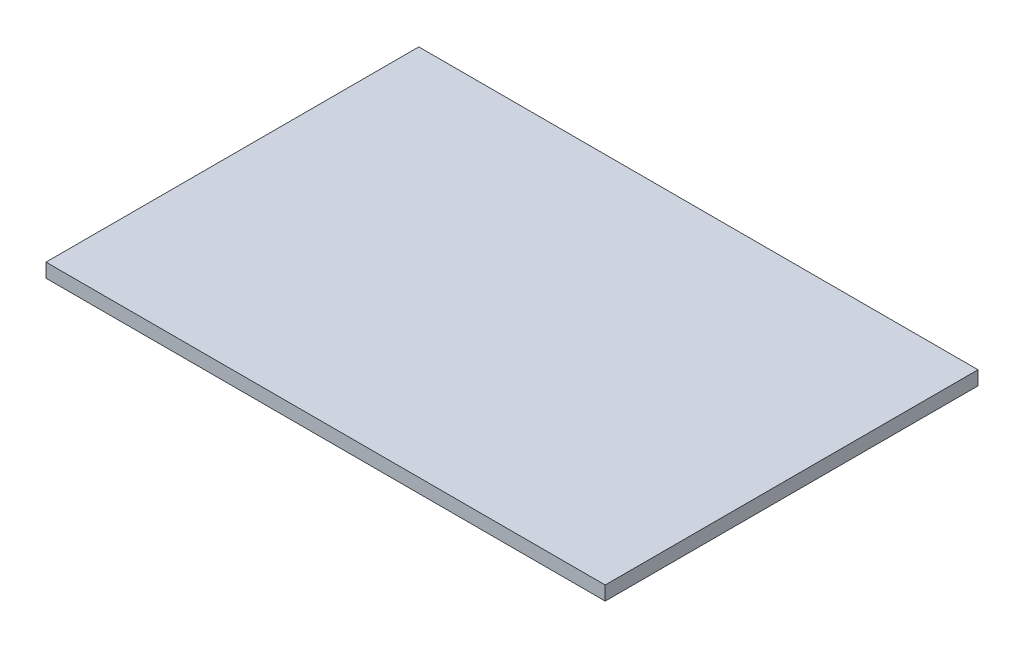
ISO-10303-21;
HEADER;
FILE_DESCRIPTION(('STEP AP214'),'2;1');
FILE_NAME('part.step','',(''),(''),'','','');
FILE_SCHEMA(('AUTOMOTIVE_DESIGN { 1 0 10303 214 1 1 1 1 }'));
ENDSEC;
DATA;
#1=APPLICATION_CONTEXT('core data for automotive mechanical design processes');
#2=APPLICATION_PROTOCOL_DEFINITION('international standard','automotive_design',2000,#1);
#3=PRODUCT_CONTEXT('',#1,'mechanical');
#4=PRODUCT('Part','Part','',(#3));
#5=PRODUCT_RELATED_PRODUCT_CATEGORY('part','',(#4));
#6=PRODUCT_DEFINITION_FORMATION('','',#4);
#7=PRODUCT_DEFINITION_CONTEXT('part definition',#1,'design');
#8=PRODUCT_DEFINITION('design','',#6,#7);
#9=PRODUCT_DEFINITION_SHAPE('','',#8);
#10=(LENGTH_UNIT() NAMED_UNIT(*) SI_UNIT(.MILLI.,.METRE.));
#11=(NAMED_UNIT(*) PLANE_ANGLE_UNIT() SI_UNIT($,.RADIAN.));
#12=(NAMED_UNIT(*) SI_UNIT($,.STERADIAN.) SOLID_ANGLE_UNIT());
#13=UNCERTAINTY_MEASURE_WITH_UNIT(LENGTH_MEASURE(1.E-05),#10,'distance_accuracy_value','');
#14=(GEOMETRIC_REPRESENTATION_CONTEXT(3) GLOBAL_UNCERTAINTY_ASSIGNED_CONTEXT((#13)) GLOBAL_UNIT_ASSIGNED_CONTEXT((#10,
#11,#12)) REPRESENTATION_CONTEXT('',''));
#15=CARTESIAN_POINT('',(0.,0.,0.));
#16=DIRECTION('',(0.,0.,1.));
#17=DIRECTION('',(1.,0.,0.));
#18=AXIS2_PLACEMENT_3D('',#15,#16,#17);
#19=CARTESIAN_POINT('',(6.,0.299999999999932,-4.));
#20=DIRECTION('',(-1.,0.,0.));
#21=DIRECTION('',(0.,0.,1.));
#22=AXIS2_PLACEMENT_3D('',#19,#20,#21);
#23=PLANE('',#22);
#24=DIRECTION('',(0.,0.,-1.));
#25=VECTOR('',#24,1.);
#26=CARTESIAN_POINT('',(6.,0.,-4.));
#27=LINE('',#26,#25);
#28=CARTESIAN_POINT('',(6.,0.,4.));
#29=VERTEX_POINT('',#28);
#30=CARTESIAN_POINT('',(6.,0.,-4.));
#31=VERTEX_POINT('',#30);
#32=EDGE_CURVE('E107',#29,#31,#27,.T.);
#33=ORIENTED_EDGE('',*,*,#32,.T.);
#34=DIRECTION('',(0.,-1.,0.));
#35=VECTOR('',#34,1.);
#36=CARTESIAN_POINT('',(6.,0.299999999999932,-4.));
#37=LINE('',#36,#35);
#38=CARTESIAN_POINT('',(6.,0.299999999999932,-4.));
#39=VERTEX_POINT('',#38);
#40=EDGE_CURVE('E11',#39,#31,#37,.T.);
#41=ORIENTED_EDGE('',*,*,#40,.F.);
#42=DIRECTION('',(0.,0.,-1.));
#43=VECTOR('',#42,1.);
#44=CARTESIAN_POINT('',(6.,0.299999999999932,-4.));
#45=LINE('',#44,#43);
#46=CARTESIAN_POINT('',(6.,0.299999999999932,4.));
#47=VERTEX_POINT('',#46);
#48=EDGE_CURVE('E91',#47,#39,#45,.T.);
#49=ORIENTED_EDGE('',*,*,#48,.F.);
#50=DIRECTION('',(0.,-1.,0.));
#51=VECTOR('',#50,1.);
#52=CARTESIAN_POINT('',(6.,0.299999999999932,4.));
#53=LINE('',#52,#51);
#54=EDGE_CURVE('E103',#47,#29,#53,.T.);
#55=ORIENTED_EDGE('',*,*,#54,.T.);
#56=EDGE_LOOP('',(#33,#41,#49,#55));
#57=FACE_BOUND('',#56,.T.);
#58=ADVANCED_FACE('F39',(#57),#23,.F.);
#59=CARTESIAN_POINT('',(-6.,0.299999999999932,-4.));
#60=DIRECTION('',(0.,0.,1.));
#61=DIRECTION('',(1.,0.,0.));
#62=AXIS2_PLACEMENT_3D('',#59,#60,#61);
#63=PLANE('',#62);
#64=DIRECTION('',(-1.,0.,0.));
#65=VECTOR('',#64,1.);
#66=CARTESIAN_POINT('',(-6.,0.,-4.));
#67=LINE('',#66,#65);
#68=CARTESIAN_POINT('',(-6.,0.,-4.));
#69=VERTEX_POINT('',#68);
#70=EDGE_CURVE('E96',#31,#69,#67,.T.);
#71=ORIENTED_EDGE('',*,*,#70,.T.);
#72=DIRECTION('',(0.,-1.,0.));
#73=VECTOR('',#72,1.);
#74=CARTESIAN_POINT('',(-6.,0.299999999999932,-4.));
#75=LINE('',#74,#73);
#76=CARTESIAN_POINT('',(-6.,0.299999999999932,-4.));
#77=VERTEX_POINT('',#76);
#78=EDGE_CURVE('E48',#77,#69,#75,.T.);
#79=ORIENTED_EDGE('',*,*,#78,.F.);
#80=DIRECTION('',(-1.,0.,0.));
#81=VECTOR('',#80,1.);
#82=CARTESIAN_POINT('',(-6.,0.299999999999932,-4.));
#83=LINE('',#82,#81);
#84=EDGE_CURVE('E86',#39,#77,#83,.T.);
#85=ORIENTED_EDGE('',*,*,#84,.F.);
#86=ORIENTED_EDGE('',*,*,#40,.T.);
#87=EDGE_LOOP('',(#71,#79,#85,#86));
#88=FACE_BOUND('',#87,.T.);
#89=ADVANCED_FACE('F95',(#88),#63,.F.);
#90=CARTESIAN_POINT('',(-6.,0.299999999999932,-4.));
#91=DIRECTION('',(1.,0.,0.));
#92=DIRECTION('',(0.,0.,-1.));
#93=AXIS2_PLACEMENT_3D('',#90,#91,#92);
#94=PLANE('',#93);
#95=DIRECTION('',(0.,0.,1.));
#96=VECTOR('',#95,1.);
#97=CARTESIAN_POINT('',(-6.,0.,-4.));
#98=LINE('',#97,#96);
#99=CARTESIAN_POINT('',(-6.,0.,4.));
#100=VERTEX_POINT('',#99);
#101=EDGE_CURVE('E73',#69,#100,#98,.T.);
#102=ORIENTED_EDGE('',*,*,#101,.T.);
#103=DIRECTION('',(0.,-1.,0.));
#104=VECTOR('',#103,1.);
#105=CARTESIAN_POINT('',(-6.,0.299999999999932,4.));
#106=LINE('',#105,#104);
#107=CARTESIAN_POINT('',(-6.,0.299999999999932,4.));
#108=VERTEX_POINT('',#107);
#109=EDGE_CURVE('E98',#108,#100,#106,.T.);
#110=ORIENTED_EDGE('',*,*,#109,.F.);
#111=DIRECTION('',(0.,0.,1.));
#112=VECTOR('',#111,1.);
#113=CARTESIAN_POINT('',(-6.,0.299999999999932,-4.));
#114=LINE('',#113,#112);
#115=EDGE_CURVE('E89',#77,#108,#114,.T.);
#116=ORIENTED_EDGE('',*,*,#115,.F.);
#117=ORIENTED_EDGE('',*,*,#78,.T.);
#118=EDGE_LOOP('',(#102,#110,#116,#117));
#119=FACE_BOUND('',#118,.T.);
#120=ADVANCED_FACE('F99',(#119),#94,.F.);
#121=CARTESIAN_POINT('',(-6.,0.299999999999932,4.));
#122=DIRECTION('',(0.,0.,-1.));
#123=DIRECTION('',(-1.,0.,0.));
#124=AXIS2_PLACEMENT_3D('',#121,#122,#123);
#125=PLANE('',#124);
#126=DIRECTION('',(1.,0.,0.));
#127=VECTOR('',#126,1.);
#128=CARTESIAN_POINT('',(-6.,0.,4.));
#129=LINE('',#128,#127);
#130=EDGE_CURVE('E79',#100,#29,#129,.T.);
#131=ORIENTED_EDGE('',*,*,#130,.T.);
#132=ORIENTED_EDGE('',*,*,#54,.F.);
#133=DIRECTION('',(1.,0.,0.));
#134=VECTOR('',#133,1.);
#135=CARTESIAN_POINT('',(-6.,0.299999999999932,4.));
#136=LINE('',#135,#134);
#137=EDGE_CURVE('E56',#108,#47,#136,.T.);
#138=ORIENTED_EDGE('',*,*,#137,.F.);
#139=ORIENTED_EDGE('',*,*,#109,.T.);
#140=EDGE_LOOP('',(#131,#132,#138,#139));
#141=FACE_BOUND('',#140,.T.);
#142=ADVANCED_FACE('F120',(#141),#125,.F.);
#143=CARTESIAN_POINT('',(0.,0.299999999999932,0.));
#144=DIRECTION('',(0.,1.,0.));
#145=DIRECTION('',(0.,0.,1.));
#146=AXIS2_PLACEMENT_3D('',#143,#144,#145);
#147=PLANE('',#146);
#148=ORIENTED_EDGE('',*,*,#48,.T.);
#149=ORIENTED_EDGE('',*,*,#84,.T.);
#150=ORIENTED_EDGE('',*,*,#115,.T.);
#151=ORIENTED_EDGE('',*,*,#137,.T.);
#152=EDGE_LOOP('',(#148,#149,#150,#151));
#153=FACE_BOUND('',#152,.T.);
#154=ADVANCED_FACE('F87',(#153),#147,.T.);
#155=CARTESIAN_POINT('',(0.,0.,0.));
#156=DIRECTION('',(0.,1.,0.));
#157=DIRECTION('',(0.,0.,1.));
#158=AXIS2_PLACEMENT_3D('',#155,#156,#157);
#159=PLANE('',#158);
#160=ORIENTED_EDGE('',*,*,#32,.F.);
#161=ORIENTED_EDGE('',*,*,#130,.F.);
#162=ORIENTED_EDGE('',*,*,#101,.F.);
#163=ORIENTED_EDGE('',*,*,#70,.F.);
#164=EDGE_LOOP('',(#160,#161,#162,#163));
#165=FACE_BOUND('',#164,.T.);
#166=ADVANCED_FACE('F123',(#165),#159,.F.);
#167=CLOSED_SHELL('',(#58,#89,#120,#142,#154,#166));
#168=MANIFOLD_SOLID_BREP('B2',#167);
#169=ADVANCED_BREP_SHAPE_REPRESENTATION('',(#18,#168),#14);
#170=SHAPE_DEFINITION_REPRESENTATION(#9,#169);
ENDSEC;
END-ISO-10303-21;
